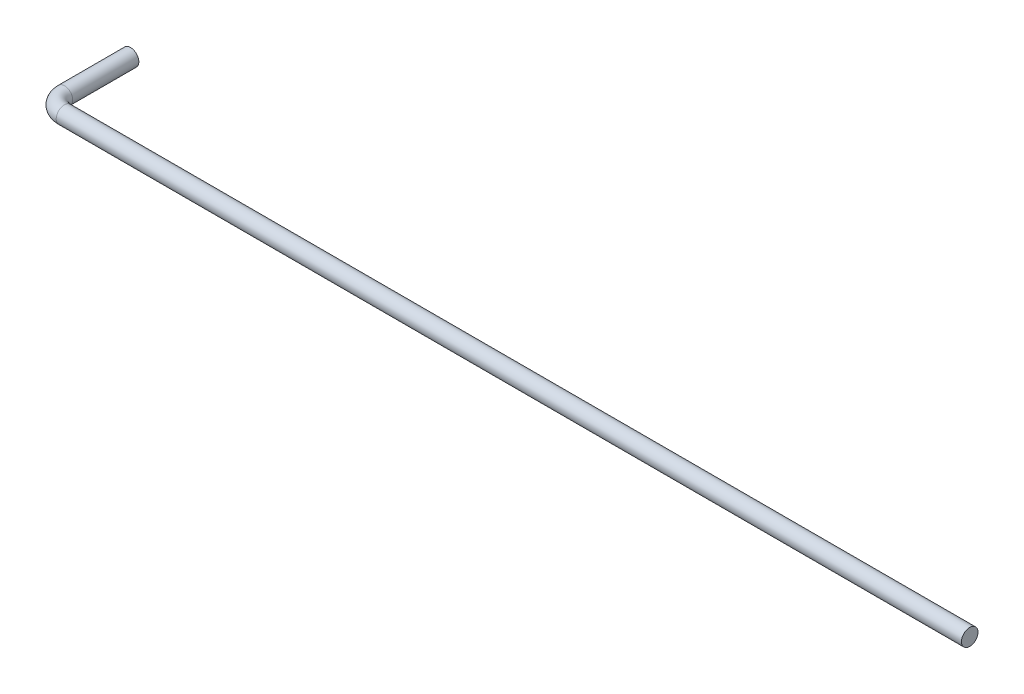
ISO-10303-21;
HEADER;
FILE_DESCRIPTION(('STEP AP214'),'2;1');
FILE_NAME('part.step','',(''),(''),'','','');
FILE_SCHEMA(('AUTOMOTIVE_DESIGN { 1 0 10303 214 1 1 1 1 }'));
ENDSEC;
DATA;
#1=APPLICATION_CONTEXT('core data for automotive mechanical design processes');
#2=APPLICATION_PROTOCOL_DEFINITION('international standard','automotive_design',2000,#1);
#3=PRODUCT_CONTEXT('',#1,'mechanical');
#4=PRODUCT('Part','Part','',(#3));
#5=PRODUCT_RELATED_PRODUCT_CATEGORY('part','',(#4));
#6=PRODUCT_DEFINITION_FORMATION('','',#4);
#7=PRODUCT_DEFINITION_CONTEXT('part definition',#1,'design');
#8=PRODUCT_DEFINITION('design','',#6,#7);
#9=PRODUCT_DEFINITION_SHAPE('','',#8);
#10=(LENGTH_UNIT() NAMED_UNIT(*) SI_UNIT(.MILLI.,.METRE.));
#11=(NAMED_UNIT(*) PLANE_ANGLE_UNIT() SI_UNIT($,.RADIAN.));
#12=(NAMED_UNIT(*) SI_UNIT($,.STERADIAN.) SOLID_ANGLE_UNIT());
#13=UNCERTAINTY_MEASURE_WITH_UNIT(LENGTH_MEASURE(1.E-05),#10,'distance_accuracy_value','');
#14=(GEOMETRIC_REPRESENTATION_CONTEXT(3) GLOBAL_UNCERTAINTY_ASSIGNED_CONTEXT((#13)) GLOBAL_UNIT_ASSIGNED_CONTEXT((#10,
#11,#12)) REPRESENTATION_CONTEXT('',''));
#15=CARTESIAN_POINT('',(0.,0.,0.));
#16=DIRECTION('',(0.,0.,1.));
#17=DIRECTION('',(1.,0.,0.));
#18=AXIS2_PLACEMENT_3D('',#15,#16,#17);
#19=CARTESIAN_POINT('',(-56.4456324582339,0.,-10.));
#20=DIRECTION('',(0.,0.,1.));
#21=DIRECTION('',(1.,0.,0.));
#22=AXIS2_PLACEMENT_3D('',#19,#20,#21);
#23=PLANE('',#22);
#24=CARTESIAN_POINT('',(-56.4456324582339,0.,-10.));
#25=DIRECTION('',(0.,0.,1.));
#26=DIRECTION('',(1.,0.,0.));
#27=AXIS2_PLACEMENT_3D('',#24,#25,#26);
#28=CIRCLE('',#27,1.);
#29=CARTESIAN_POINT('',(-55.4456324582339,0.,-10.));
#30=VERTEX_POINT('',#29);
#31=EDGE_CURVE('E57',#30,#30,#28,.T.);
#32=ORIENTED_EDGE('',*,*,#31,.F.);
#33=EDGE_LOOP('',(#32));
#34=FACE_BOUND('',#33,.T.);
#35=ADVANCED_FACE('F45',(#34),#23,.F.);
#36=CARTESIAN_POINT('',(55.1143675417661,0.,0.));
#37=DIRECTION('',(1.,0.,0.));
#38=DIRECTION('',(0.,0.,-1.));
#39=AXIS2_PLACEMENT_3D('',#36,#37,#38);
#40=PLANE('',#39);
#41=CARTESIAN_POINT('',(55.1143675417661,0.,0.));
#42=DIRECTION('',(1.,0.,0.));
#43=DIRECTION('',(0.,0.,-1.));
#44=AXIS2_PLACEMENT_3D('',#41,#42,#43);
#45=CIRCLE('',#44,1.);
#46=CARTESIAN_POINT('',(55.1143675417661,0.,-1.));
#47=VERTEX_POINT('',#46);
#48=EDGE_CURVE('E12',#47,#47,#45,.T.);
#49=ORIENTED_EDGE('',*,*,#48,.T.);
#50=EDGE_LOOP('',(#49));
#51=FACE_BOUND('',#50,.T.);
#52=ADVANCED_FACE('F60',(#51),#40,.T.);
#53=CARTESIAN_POINT('',(-56.4456324582339,0.,-10.));
#54=DIRECTION('',(0.,0.,1.));
#55=DIRECTION('',(1.,0.,0.));
#56=AXIS2_PLACEMENT_3D('',#53,#54,#55);
#57=CYLINDRICAL_SURFACE('',#56,1.);
#58=CARTESIAN_POINT('',(-56.4456324582339,0.,-2.00000000000001));
#59=DIRECTION('',(0.,0.,1.));
#60=DIRECTION('',(1.,0.,0.));
#61=AXIS2_PLACEMENT_3D('',#58,#59,#60);
#62=CIRCLE('',#61,1.);
#63=CARTESIAN_POINT('',(-57.445632458234,0.,-2.00000000000002));
#64=VERTEX_POINT('',#63);
#65=EDGE_CURVE('E70',#64,#64,#62,.T.);
#66=ORIENTED_EDGE('',*,*,#65,.F.);
#67=EDGE_LOOP('',(#66));
#68=FACE_BOUND('',#67,.T.);
#69=ORIENTED_EDGE('',*,*,#31,.T.);
#70=EDGE_LOOP('',(#69));
#71=FACE_BOUND('',#70,.T.);
#72=ADVANCED_FACE('F75',(#68,#71),#57,.T.);
#73=CARTESIAN_POINT('',(-54.4456324582339,0.,-2.));
#74=DIRECTION('',(0.,1.,0.));
#75=DIRECTION('',(0.,0.,1.));
#76=AXIS2_PLACEMENT_3D('',#73,#74,#75);
#77=TOROIDAL_SURFACE('',#76,2.00000000000008,1.);
#78=CARTESIAN_POINT('',(-54.4456324582339,0.,0.));
#79=DIRECTION('',(1.,0.,0.));
#80=DIRECTION('',(0.,0.,-1.));
#81=AXIS2_PLACEMENT_3D('',#78,#79,#80);
#82=CIRCLE('',#81,1.);
#83=CARTESIAN_POINT('',(-54.4456324582339,0.,1.00000000000008));
#84=VERTEX_POINT('',#83);
#85=EDGE_CURVE('E52',#84,#84,#82,.T.);
#86=CARTESIAN_POINT('',(-54.4456324582339,0.,-2.));
#87=DIRECTION('',(0.,1.,0.));
#88=DIRECTION('',(0.,0.,1.));
#89=AXIS2_PLACEMENT_3D('',#86,#87,#88);
#90=CIRCLE('',#89,3.00000000000008);
#91=EDGE_CURVE('',#64,#84,#90,.T.);
#92=ORIENTED_EDGE('',*,*,#65,.T.);
#93=ORIENTED_EDGE('',*,*,#85,.F.);
#94=ORIENTED_EDGE('',*,*,#91,.T.);
#95=ORIENTED_EDGE('',*,*,#91,.F.);
#96=EDGE_LOOP('',(#92,#94,#93,#95));
#97=FACE_BOUND('',#96,.T.);
#98=ADVANCED_FACE('F65',(#97),#77,.T.);
#99=CARTESIAN_POINT('',(-54.4456324582339,0.,0.));
#100=DIRECTION('',(1.,0.,0.));
#101=DIRECTION('',(0.,0.,-1.));
#102=AXIS2_PLACEMENT_3D('',#99,#100,#101);
#103=CYLINDRICAL_SURFACE('',#102,1.);
#104=ORIENTED_EDGE('',*,*,#48,.F.);
#105=EDGE_LOOP('',(#104));
#106=FACE_BOUND('',#105,.T.);
#107=ORIENTED_EDGE('',*,*,#85,.T.);
#108=EDGE_LOOP('',(#107));
#109=FACE_BOUND('',#108,.T.);
#110=ADVANCED_FACE('F62',(#106,#109),#103,.T.);
#111=CLOSED_SHELL('',(#35,#52,#72,#98,#110));
#112=MANIFOLD_SOLID_BREP('B2',#111);
#113=ADVANCED_BREP_SHAPE_REPRESENTATION('',(#18,#112),#14);
#114=SHAPE_DEFINITION_REPRESENTATION(#9,#113);
ENDSEC;
END-ISO-10303-21;
